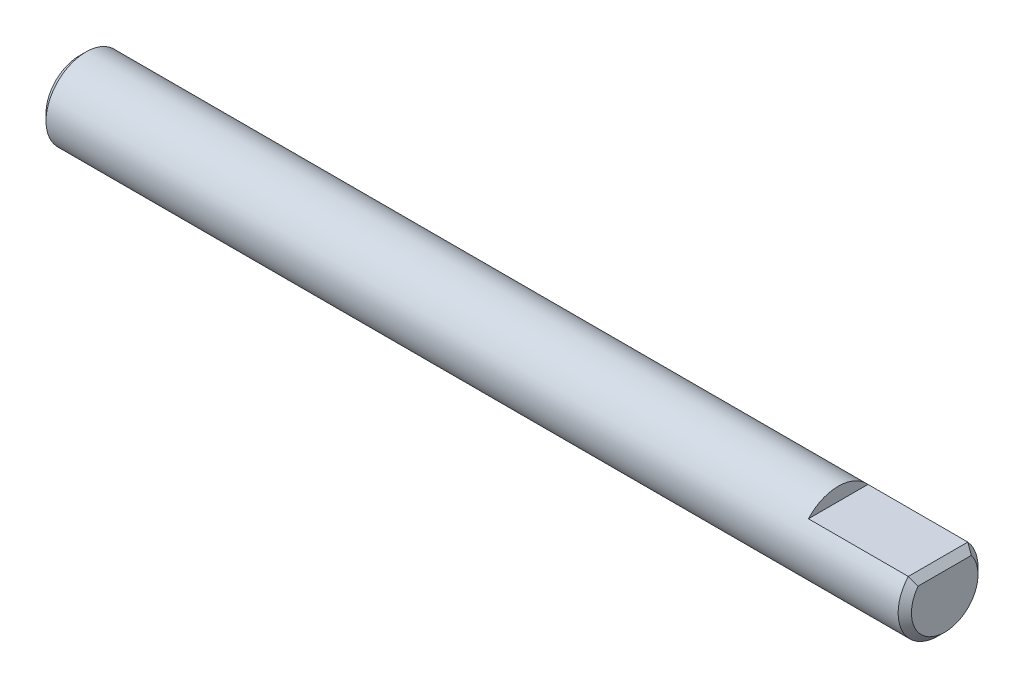
ISO-10303-21;
HEADER;
FILE_DESCRIPTION(('STEP AP214'),'2;1');
FILE_NAME('part.step','',(''),(''),'','','');
FILE_SCHEMA(('AUTOMOTIVE_DESIGN { 1 0 10303 214 1 1 1 1 }'));
ENDSEC;
DATA;
#1=APPLICATION_CONTEXT('core data for automotive mechanical design processes');
#2=APPLICATION_PROTOCOL_DEFINITION('international standard','automotive_design',2000,#1);
#3=PRODUCT_CONTEXT('',#1,'mechanical');
#4=PRODUCT('Part','Part','',(#3));
#5=PRODUCT_RELATED_PRODUCT_CATEGORY('part','',(#4));
#6=PRODUCT_DEFINITION_FORMATION('','',#4);
#7=PRODUCT_DEFINITION_CONTEXT('part definition',#1,'design');
#8=PRODUCT_DEFINITION('design','',#6,#7);
#9=PRODUCT_DEFINITION_SHAPE('','',#8);
#10=(LENGTH_UNIT() NAMED_UNIT(*) SI_UNIT(.MILLI.,.METRE.));
#11=(NAMED_UNIT(*) PLANE_ANGLE_UNIT() SI_UNIT($,.RADIAN.));
#12=(NAMED_UNIT(*) SI_UNIT($,.STERADIAN.) SOLID_ANGLE_UNIT());
#13=UNCERTAINTY_MEASURE_WITH_UNIT(LENGTH_MEASURE(1.E-05),#10,'distance_accuracy_value','');
#14=(GEOMETRIC_REPRESENTATION_CONTEXT(3) GLOBAL_UNCERTAINTY_ASSIGNED_CONTEXT((#13)) GLOBAL_UNIT_ASSIGNED_CONTEXT((#10,
#11,#12)) REPRESENTATION_CONTEXT('',''));
#15=CARTESIAN_POINT('',(0.,0.,0.));
#16=DIRECTION('',(0.,0.,1.));
#17=DIRECTION('',(1.,0.,0.));
#18=AXIS2_PLACEMENT_3D('',#15,#16,#17);
#19=CARTESIAN_POINT('',(32.5,0.,0.));
#20=DIRECTION('',(-1.,0.,0.));
#21=DIRECTION('',(0.,0.,1.));
#22=AXIS2_PLACEMENT_3D('',#19,#20,#21);
#23=CYLINDRICAL_SURFACE('',#22,3.);
#24=CARTESIAN_POINT('',(-32.,0.,0.));
#25=DIRECTION('',(1.,0.,0.));
#26=DIRECTION('',(0.,0.,-1.));
#27=AXIS2_PLACEMENT_3D('',#24,#25,#26);
#28=CIRCLE('',#27,3.);
#29=CARTESIAN_POINT('',(-32.,0.,-3.));
#30=VERTEX_POINT('',#29);
#31=EDGE_CURVE('E97',#30,#30,#28,.T.);
#32=ORIENTED_EDGE('',*,*,#31,.T.);
#33=EDGE_LOOP('',(#32));
#34=FACE_BOUND('',#33,.T.);
#35=DIRECTION('',(1.,0.,0.));
#36=VECTOR('',#35,1.);
#37=CARTESIAN_POINT('',(24.5,2.,-2.23606797749979));
#38=LINE('',#37,#36);
#39=CARTESIAN_POINT('',(24.5,2.,-2.23606797749979));
#40=VERTEX_POINT('',#39);
#41=CARTESIAN_POINT('',(32.,2.,-2.23606797749979));
#42=VERTEX_POINT('',#41);
#43=EDGE_CURVE('E89',#40,#42,#38,.T.);
#44=ORIENTED_EDGE('',*,*,#43,.T.);
#45=CARTESIAN_POINT('',(32.,0.,0.));
#46=DIRECTION('',(1.,0.,0.));
#47=DIRECTION('',(0.,0.,-1.));
#48=AXIS2_PLACEMENT_3D('',#45,#46,#47);
#49=CIRCLE('',#48,3.);
#50=CARTESIAN_POINT('',(32.,2.,2.23606797749979));
#51=VERTEX_POINT('',#50);
#52=EDGE_CURVE('E92',#42,#51,#49,.F.);
#53=ORIENTED_EDGE('',*,*,#52,.T.);
#54=DIRECTION('',(1.,0.,0.));
#55=VECTOR('',#54,1.);
#56=CARTESIAN_POINT('',(24.5,2.,2.23606797749979));
#57=LINE('',#56,#55);
#58=CARTESIAN_POINT('',(24.5,2.,2.23606797749979));
#59=VERTEX_POINT('',#58);
#60=EDGE_CURVE('E88',#59,#51,#57,.T.);
#61=ORIENTED_EDGE('',*,*,#60,.F.);
#62=CARTESIAN_POINT('',(24.5,0.,0.));
#63=DIRECTION('',(1.,0.,0.));
#64=DIRECTION('',(0.,0.,-1.));
#65=AXIS2_PLACEMENT_3D('',#62,#63,#64);
#66=CIRCLE('',#65,3.);
#67=EDGE_CURVE('E77',#40,#59,#66,.T.);
#68=ORIENTED_EDGE('',*,*,#67,.F.);
#69=EDGE_LOOP('',(#44,#53,#61,#68));
#70=FACE_BOUND('',#69,.T.);
#71=ADVANCED_FACE('F34',(#34,#70),#23,.T.);
#72=CARTESIAN_POINT('',(32.5,0.,0.));
#73=DIRECTION('',(1.,0.,0.));
#74=DIRECTION('',(0.,0.,-1.));
#75=AXIS2_PLACEMENT_3D('',#72,#73,#74);
#76=PLANE('',#75);
#77=DIRECTION('',(0.,0.,1.));
#78=VECTOR('',#77,1.);
#79=CARTESIAN_POINT('',(32.5,1.5,2.23606797749979));
#80=LINE('',#79,#78);
#81=CARTESIAN_POINT('',(32.5,1.5,-2.));
#82=VERTEX_POINT('',#81);
#83=CARTESIAN_POINT('',(32.5,1.5,2.));
#84=VERTEX_POINT('',#83);
#85=EDGE_CURVE('E55',#82,#84,#80,.T.);
#86=ORIENTED_EDGE('',*,*,#85,.T.);
#87=CARTESIAN_POINT('',(32.5,0.,0.));
#88=DIRECTION('',(1.,0.,0.));
#89=DIRECTION('',(0.,0.,-1.));
#90=AXIS2_PLACEMENT_3D('',#87,#88,#89);
#91=CIRCLE('',#90,2.5);
#92=EDGE_CURVE('E48',#84,#82,#91,.T.);
#93=ORIENTED_EDGE('',*,*,#92,.T.);
#94=EDGE_LOOP('',(#86,#93));
#95=FACE_BOUND('',#94,.T.);
#96=ADVANCED_FACE('F120',(#95),#76,.T.);
#97=CARTESIAN_POINT('',(-32.5,0.,0.));
#98=DIRECTION('',(1.,0.,0.));
#99=DIRECTION('',(0.,0.,-1.));
#100=AXIS2_PLACEMENT_3D('',#97,#98,#99);
#101=PLANE('',#100);
#102=CARTESIAN_POINT('',(-32.5,0.,0.));
#103=DIRECTION('',(1.,0.,0.));
#104=DIRECTION('',(0.,0.,-1.));
#105=AXIS2_PLACEMENT_3D('',#102,#103,#104);
#106=CIRCLE('',#105,2.50000000000002);
#107=CARTESIAN_POINT('',(-32.5,0.,-2.50000000000002));
#108=VERTEX_POINT('',#107);
#109=EDGE_CURVE('E100',#108,#108,#106,.F.);
#110=ORIENTED_EDGE('',*,*,#109,.T.);
#111=EDGE_LOOP('',(#110));
#112=FACE_BOUND('',#111,.T.);
#113=ADVANCED_FACE('F122',(#112),#101,.F.);
#114=CARTESIAN_POINT('',(24.5,2.,2.23606797749979));
#115=DIRECTION('',(0.,-1.,0.));
#116=DIRECTION('',(0.,0.,-1.));
#117=AXIS2_PLACEMENT_3D('',#114,#115,#116);
#118=PLANE('',#117);
#119=ORIENTED_EDGE('',*,*,#60,.T.);
#120=DIRECTION('',(0.,0.,-1.));
#121=VECTOR('',#120,1.);
#122=CARTESIAN_POINT('',(32.,2.,-2.23606797749979));
#123=LINE('',#122,#121);
#124=EDGE_CURVE('E11',#51,#42,#123,.T.);
#125=ORIENTED_EDGE('',*,*,#124,.T.);
#126=ORIENTED_EDGE('',*,*,#43,.F.);
#127=DIRECTION('',(0.,0.,-1.));
#128=VECTOR('',#127,1.);
#129=CARTESIAN_POINT('',(24.5,2.,2.23606797749979));
#130=LINE('',#129,#128);
#131=EDGE_CURVE('E80',#59,#40,#130,.T.);
#132=ORIENTED_EDGE('',*,*,#131,.F.);
#133=EDGE_LOOP('',(#119,#125,#126,#132));
#134=FACE_BOUND('',#133,.T.);
#135=ADVANCED_FACE('F87',(#134),#118,.F.);
#136=CARTESIAN_POINT('',(24.5,0.,0.));
#137=DIRECTION('',(1.,0.,0.));
#138=DIRECTION('',(0.,0.,-1.));
#139=AXIS2_PLACEMENT_3D('',#136,#137,#138);
#140=PLANE('',#139);
#141=ORIENTED_EDGE('',*,*,#67,.T.);
#142=ORIENTED_EDGE('',*,*,#131,.T.);
#143=EDGE_LOOP('',(#141,#142));
#144=FACE_BOUND('',#143,.T.);
#145=ADVANCED_FACE('F79',(#144),#140,.T.);
#146=CARTESIAN_POINT('',(-32.,0.,0.));
#147=DIRECTION('',(1.,0.,0.));
#148=DIRECTION('',(0.,0.,-1.));
#149=AXIS2_PLACEMENT_3D('',#146,#147,#148);
#150=CONICAL_SURFACE('',#149,3.,0.785398163397446);
#151=ORIENTED_EDGE('',*,*,#109,.F.);
#152=EDGE_LOOP('',(#151));
#153=FACE_BOUND('',#152,.T.);
#154=ORIENTED_EDGE('',*,*,#31,.F.);
#155=EDGE_LOOP('',(#154));
#156=FACE_BOUND('',#155,.T.);
#157=ADVANCED_FACE('F112',(#153,#156),#150,.T.);
#158=CARTESIAN_POINT('',(32.,2.,2.23606797749979));
#159=DIRECTION('',(0.707106781186547,0.707106781186547,0.));
#160=DIRECTION('',(0.,0.,1.));
#161=AXIS2_PLACEMENT_3D('',#158,#159,#160);
#162=PLANE('',#161);
#163=CARTESIAN_POINT('',(32.5,1.5,-2.));
#164=CARTESIAN_POINT('',(32.4585807977048,1.54141920229523,-2.02070857912985));
#165=CARTESIAN_POINT('',(32.4170908559515,1.58290914404846,-2.04113293454125));
#166=CARTESIAN_POINT('',(32.3339853655915,1.6660146344085,-2.08145061491556));
#167=CARTESIAN_POINT('',(32.2923698259851,1.70763017401492,-2.10134397696905));
#168=CARTESIAN_POINT('',(32.2090238468854,1.79097615311456,-2.14063967558382));
#169=CARTESIAN_POINT('',(32.167293409167,1.83270659083301,-2.16004201968289));
#170=CARTESIAN_POINT('',(32.0837244510337,1.91627554896634,-2.19838987344755));
#171=CARTESIAN_POINT('',(32.0418859232564,1.95811407674361,-2.21733535103477));
#172=CARTESIAN_POINT('',(32.,2.,-2.23606797749979));
#173=B_SPLINE_CURVE_WITH_KNOTS('',3,(#163,#164,#165,#166,#167,#168,#169,#170,#171,#172),
.UNSPECIFIED.,.F.,.F.,(4,2,2,2,4),(0.,0.186384056083043,0.372755058743468,0.559123198618541,
0.745504386246809),.UNSPECIFIED.);
#174=EDGE_CURVE('E63',#42,#82,#173,.F.);
#175=ORIENTED_EDGE('',*,*,#174,.F.);
#176=ORIENTED_EDGE('',*,*,#124,.F.);
#177=CARTESIAN_POINT('',(32.,2.,2.23606797749979));
#178=CARTESIAN_POINT('',(32.0418859232564,1.95811407674361,2.21733535103477));
#179=CARTESIAN_POINT('',(32.0837244510337,1.91627554896634,2.19838987344755));
#180=CARTESIAN_POINT('',(32.167293409167,1.83270659083301,2.16004201968289));
#181=CARTESIAN_POINT('',(32.2090238468854,1.79097615311456,2.14063967558382));
#182=CARTESIAN_POINT('',(32.2923698259851,1.70763017401492,2.10134397696905));
#183=CARTESIAN_POINT('',(32.3339853655915,1.6660146344085,2.08145061491556));
#184=CARTESIAN_POINT('',(32.4170908559515,1.58290914404846,2.04113293454125));
#185=CARTESIAN_POINT('',(32.4585807977048,1.54141920229523,2.02070857912985));
#186=CARTESIAN_POINT('',(32.5,1.5,2.));
#187=B_SPLINE_CURVE_WITH_KNOTS('',3,(#177,#178,#179,#180,#181,#182,#183,#184,#185,#186),
.UNSPECIFIED.,.F.,.F.,(4,2,2,2,4),(0.,0.186381187628272,0.372749327503342,0.559120330163767,
0.74550438624681),.UNSPECIFIED.);
#188=EDGE_CURVE('E39',#84,#51,#187,.F.);
#189=ORIENTED_EDGE('',*,*,#188,.F.);
#190=ORIENTED_EDGE('',*,*,#85,.F.);
#191=EDGE_LOOP('',(#175,#176,#189,#190));
#192=FACE_BOUND('',#191,.T.);
#193=ADVANCED_FACE('F108',(#192),#162,.T.);
#194=CARTESIAN_POINT('',(32.5,0.,0.));
#195=DIRECTION('',(-1.,0.,0.));
#196=DIRECTION('',(0.,0.,1.));
#197=AXIS2_PLACEMENT_3D('',#194,#195,#196);
#198=CONICAL_SURFACE('',#197,2.5,0.785398163397448);
#199=ORIENTED_EDGE('',*,*,#188,.T.);
#200=ORIENTED_EDGE('',*,*,#52,.F.);
#201=ORIENTED_EDGE('',*,*,#174,.T.);
#202=ORIENTED_EDGE('',*,*,#92,.F.);
#203=EDGE_LOOP('',(#199,#200,#201,#202));
#204=FACE_BOUND('',#203,.T.);
#205=ADVANCED_FACE('F36',(#204),#198,.T.);
#206=CLOSED_SHELL('',(#71,#96,#113,#135,#145,#157,#193,#205));
#207=MANIFOLD_SOLID_BREP('B2',#206);
#208=ADVANCED_BREP_SHAPE_REPRESENTATION('',(#18,#207),#14);
#209=SHAPE_DEFINITION_REPRESENTATION(#9,#208);
ENDSEC;
END-ISO-10303-21;
